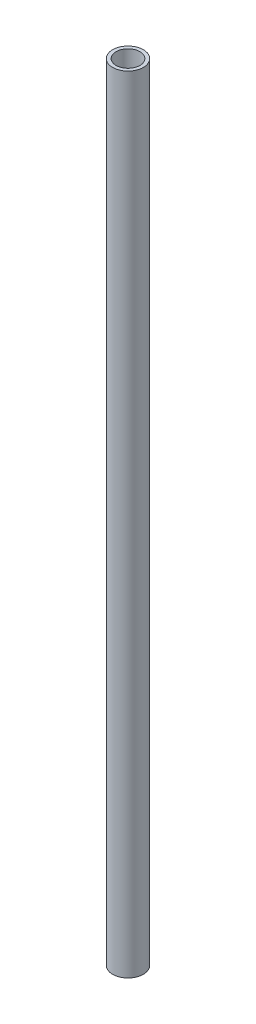
ISO-10303-21;
HEADER;
FILE_DESCRIPTION(('STEP AP214'),'2;1');
FILE_NAME('part.step','',(''),(''),'','','');
FILE_SCHEMA(('AUTOMOTIVE_DESIGN { 1 0 10303 214 1 1 1 1 }'));
ENDSEC;
DATA;
#1=APPLICATION_CONTEXT('core data for automotive mechanical design processes');
#2=APPLICATION_PROTOCOL_DEFINITION('international standard','automotive_design',2000,#1);
#3=PRODUCT_CONTEXT('',#1,'mechanical');
#4=PRODUCT('Part','Part','',(#3));
#5=PRODUCT_RELATED_PRODUCT_CATEGORY('part','',(#4));
#6=PRODUCT_DEFINITION_FORMATION('','',#4);
#7=PRODUCT_DEFINITION_CONTEXT('part definition',#1,'design');
#8=PRODUCT_DEFINITION('design','',#6,#7);
#9=PRODUCT_DEFINITION_SHAPE('','',#8);
#10=(LENGTH_UNIT() NAMED_UNIT(*) SI_UNIT(.MILLI.,.METRE.));
#11=(NAMED_UNIT(*) PLANE_ANGLE_UNIT() SI_UNIT($,.RADIAN.));
#12=(NAMED_UNIT(*) SI_UNIT($,.STERADIAN.) SOLID_ANGLE_UNIT());
#13=UNCERTAINTY_MEASURE_WITH_UNIT(LENGTH_MEASURE(1.E-05),#10,'distance_accuracy_value','');
#14=(GEOMETRIC_REPRESENTATION_CONTEXT(3) GLOBAL_UNCERTAINTY_ASSIGNED_CONTEXT((#13)) GLOBAL_UNIT_ASSIGNED_CONTEXT((#10,
#11,#12)) REPRESENTATION_CONTEXT('',''));
#15=CARTESIAN_POINT('',(0.,0.,0.));
#16=DIRECTION('',(0.,0.,1.));
#17=DIRECTION('',(1.,0.,0.));
#18=AXIS2_PLACEMENT_3D('',#15,#16,#17);
#19=CARTESIAN_POINT('',(0.,115.,0.));
#20=DIRECTION('',(0.,1.,0.));
#21=DIRECTION('',(0.,0.,1.));
#22=AXIS2_PLACEMENT_3D('',#19,#20,#21);
#23=PLANE('',#22);
#24=CARTESIAN_POINT('',(0.,115.,0.));
#25=DIRECTION('',(0.,1.,0.));
#26=DIRECTION('',(0.,0.,1.));
#27=AXIS2_PLACEMENT_3D('',#24,#25,#26);
#28=CIRCLE('',#27,2.25);
#29=CARTESIAN_POINT('',(0.,115.,2.25));
#30=VERTEX_POINT('',#29);
#31=EDGE_CURVE('E10',#30,#30,#28,.T.);
#32=ORIENTED_EDGE('',*,*,#31,.T.);
#33=EDGE_LOOP('',(#32));
#34=FACE_BOUND('',#33,.T.);
#35=CARTESIAN_POINT('',(0.,115.,0.));
#36=DIRECTION('',(0.,1.,0.));
#37=DIRECTION('',(0.,0.,1.));
#38=AXIS2_PLACEMENT_3D('',#35,#36,#37);
#39=CIRCLE('',#38,1.75);
#40=CARTESIAN_POINT('',(0.,115.,1.75));
#41=VERTEX_POINT('',#40);
#42=EDGE_CURVE('E42',#41,#41,#39,.T.);
#43=ORIENTED_EDGE('',*,*,#42,.F.);
#44=EDGE_LOOP('',(#43));
#45=FACE_BOUND('',#44,.T.);
#46=ADVANCED_FACE('F31',(#34,#45),#23,.T.);
#47=CARTESIAN_POINT('',(0.,0.,0.));
#48=DIRECTION('',(0.,1.,0.));
#49=DIRECTION('',(0.,0.,1.));
#50=AXIS2_PLACEMENT_3D('',#47,#48,#49);
#51=PLANE('',#50);
#52=CARTESIAN_POINT('',(0.,0.,0.));
#53=DIRECTION('',(0.,1.,0.));
#54=DIRECTION('',(0.,0.,1.));
#55=AXIS2_PLACEMENT_3D('',#52,#53,#54);
#56=CIRCLE('',#55,2.25);
#57=CARTESIAN_POINT('',(0.,0.,2.25));
#58=VERTEX_POINT('',#57);
#59=EDGE_CURVE('E35',#58,#58,#56,.T.);
#60=ORIENTED_EDGE('',*,*,#59,.F.);
#61=EDGE_LOOP('',(#60));
#62=FACE_BOUND('',#61,.T.);
#63=CARTESIAN_POINT('',(0.,0.,0.));
#64=DIRECTION('',(0.,1.,0.));
#65=DIRECTION('',(0.,0.,1.));
#66=AXIS2_PLACEMENT_3D('',#63,#64,#65);
#67=CIRCLE('',#66,1.75);
#68=CARTESIAN_POINT('',(0.,0.,1.75));
#69=VERTEX_POINT('',#68);
#70=EDGE_CURVE('E44',#69,#69,#67,.T.);
#71=ORIENTED_EDGE('',*,*,#70,.T.);
#72=EDGE_LOOP('',(#71));
#73=FACE_BOUND('',#72,.T.);
#74=ADVANCED_FACE('F54',(#62,#73),#51,.F.);
#75=CARTESIAN_POINT('',(0.,115.,0.));
#76=DIRECTION('',(0.,-1.,0.));
#77=DIRECTION('',(0.,0.,-1.));
#78=AXIS2_PLACEMENT_3D('',#75,#76,#77);
#79=CYLINDRICAL_SURFACE('',#78,2.25);
#80=ORIENTED_EDGE('',*,*,#31,.F.);
#81=EDGE_LOOP('',(#80));
#82=FACE_BOUND('',#81,.T.);
#83=ORIENTED_EDGE('',*,*,#59,.T.);
#84=EDGE_LOOP('',(#83));
#85=FACE_BOUND('',#84,.T.);
#86=ADVANCED_FACE('F33',(#82,#85),#79,.T.);
#87=CARTESIAN_POINT('',(0.,115.,0.));
#88=DIRECTION('',(0.,-1.,0.));
#89=DIRECTION('',(0.,0.,-1.));
#90=AXIS2_PLACEMENT_3D('',#87,#88,#89);
#91=CYLINDRICAL_SURFACE('',#90,1.75);
#92=ORIENTED_EDGE('',*,*,#42,.T.);
#93=EDGE_LOOP('',(#92));
#94=FACE_BOUND('',#93,.T.);
#95=ORIENTED_EDGE('',*,*,#70,.F.);
#96=EDGE_LOOP('',(#95));
#97=FACE_BOUND('',#96,.T.);
#98=ADVANCED_FACE('F50',(#94,#97),#91,.F.);
#99=CLOSED_SHELL('',(#46,#74,#86,#98));
#100=MANIFOLD_SOLID_BREP('B2',#99);
#101=ADVANCED_BREP_SHAPE_REPRESENTATION('',(#18,#100),#14);
#102=SHAPE_DEFINITION_REPRESENTATION(#9,#101);
ENDSEC;
END-ISO-10303-21;
